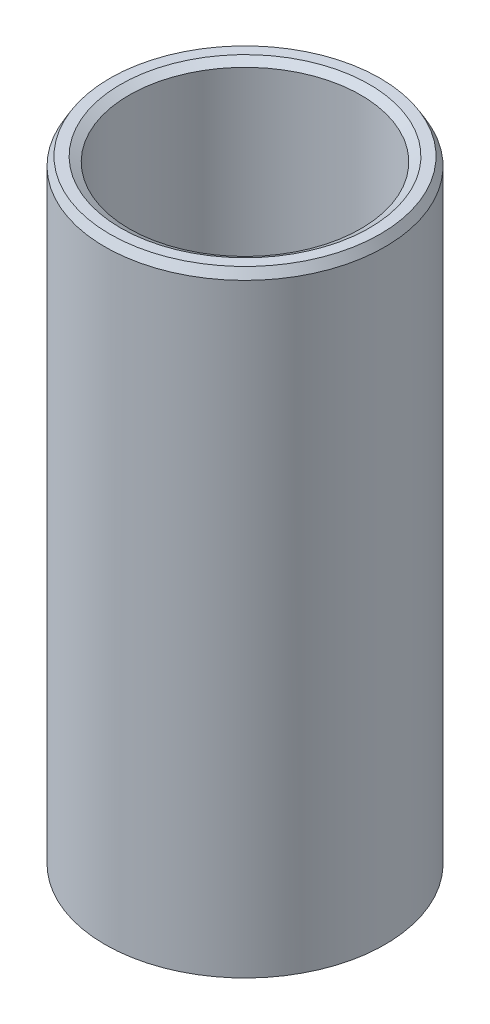
ISO-10303-21;
HEADER;
FILE_DESCRIPTION(('STEP AP214'),'2;1');
FILE_NAME('part.step','',(''),(''),'','','');
FILE_SCHEMA(('AUTOMOTIVE_DESIGN { 1 0 10303 214 1 1 1 1 }'));
ENDSEC;
DATA;
#1=APPLICATION_CONTEXT('core data for automotive mechanical design processes');
#2=APPLICATION_PROTOCOL_DEFINITION('international standard','automotive_design',2000,#1);
#3=PRODUCT_CONTEXT('',#1,'mechanical');
#4=PRODUCT('Part','Part','',(#3));
#5=PRODUCT_RELATED_PRODUCT_CATEGORY('part','',(#4));
#6=PRODUCT_DEFINITION_FORMATION('','',#4);
#7=PRODUCT_DEFINITION_CONTEXT('part definition',#1,'design');
#8=PRODUCT_DEFINITION('design','',#6,#7);
#9=PRODUCT_DEFINITION_SHAPE('','',#8);
#10=(LENGTH_UNIT() NAMED_UNIT(*) SI_UNIT(.MILLI.,.METRE.));
#11=(NAMED_UNIT(*) PLANE_ANGLE_UNIT() SI_UNIT($,.RADIAN.));
#12=(NAMED_UNIT(*) SI_UNIT($,.STERADIAN.) SOLID_ANGLE_UNIT());
#13=UNCERTAINTY_MEASURE_WITH_UNIT(LENGTH_MEASURE(1.E-05),#10,'distance_accuracy_value','');
#14=(GEOMETRIC_REPRESENTATION_CONTEXT(3) GLOBAL_UNCERTAINTY_ASSIGNED_CONTEXT((#13)) GLOBAL_UNIT_ASSIGNED_CONTEXT((#10,
#11,#12)) REPRESENTATION_CONTEXT('',''));
#15=CARTESIAN_POINT('',(0.,0.,0.));
#16=DIRECTION('',(0.,0.,1.));
#17=DIRECTION('',(1.,0.,0.));
#18=AXIS2_PLACEMENT_3D('',#15,#16,#17);
#19=CARTESIAN_POINT('',(0.,198.479711633485,0.));
#20=DIRECTION('',(0.,-1.,0.));
#21=DIRECTION('',(0.,0.,-1.));
#22=AXIS2_PLACEMENT_3D('',#19,#20,#21);
#23=CYLINDRICAL_SURFACE('',#22,45.);
#24=CARTESIAN_POINT('',(0.,1.58917507825154,0.));
#25=DIRECTION('',(0.,1.,0.));
#26=DIRECTION('',(0.,0.,1.));
#27=AXIS2_PLACEMENT_3D('',#24,#25,#26);
#28=CIRCLE('',#27,45.);
#29=CARTESIAN_POINT('',(0.,1.58917507825154,45.));
#30=VERTEX_POINT('',#29);
#31=EDGE_CURVE('E10',#30,#30,#28,.T.);
#32=ORIENTED_EDGE('',*,*,#31,.T.);
#33=EDGE_LOOP('',(#32));
#34=FACE_BOUND('',#33,.T.);
#35=CARTESIAN_POINT('',(0.,195.727179655831,0.));
#36=DIRECTION('',(0.,1.,0.));
#37=DIRECTION('',(0.,0.,1.));
#38=AXIS2_PLACEMENT_3D('',#35,#36,#37);
#39=CIRCLE('',#38,45.);
#40=CARTESIAN_POINT('',(0.,195.727179655831,-45.));
#41=VERTEX_POINT('',#40);
#42=EDGE_CURVE('E50',#41,#41,#39,.F.);
#43=ORIENTED_EDGE('',*,*,#42,.T.);
#44=EDGE_LOOP('',(#43));
#45=FACE_BOUND('',#44,.T.);
#46=ADVANCED_FACE('F39',(#34,#45),#23,.T.);
#47=CARTESIAN_POINT('',(0.,198.479711633485,0.));
#48=DIRECTION('',(0.,1.,0.));
#49=DIRECTION('',(0.,0.,1.));
#50=AXIS2_PLACEMENT_3D('',#47,#48,#49);
#51=PLANE('',#50);
#52=CARTESIAN_POINT('',(0.,198.479711633485,0.));
#53=DIRECTION('',(0.,1.,0.));
#54=DIRECTION('',(0.,0.,1.));
#55=AXIS2_PLACEMENT_3D('',#52,#53,#54);
#56=CIRCLE('',#55,39.9764231224222);
#57=CARTESIAN_POINT('',(0.,198.479711633485,39.9764231224222));
#58=VERTEX_POINT('',#57);
#59=EDGE_CURVE('E58',#58,#58,#56,.F.);
#60=ORIENTED_EDGE('',*,*,#59,.T.);
#61=EDGE_LOOP('',(#60));
#62=FACE_BOUND('',#61,.T.);
#63=CARTESIAN_POINT('',(0.,198.479711633485,0.));
#64=DIRECTION('',(0.,1.,0.));
#65=DIRECTION('',(0.,0.,1.));
#66=AXIS2_PLACEMENT_3D('',#63,#64,#65);
#67=CIRCLE('',#66,43.4108249217484);
#68=CARTESIAN_POINT('',(0.,198.479711633485,-43.4108249217484));
#69=VERTEX_POINT('',#68);
#70=EDGE_CURVE('E61',#69,#69,#67,.T.);
#71=ORIENTED_EDGE('',*,*,#70,.T.);
#72=EDGE_LOOP('',(#71));
#73=FACE_BOUND('',#72,.T.);
#74=ADVANCED_FACE('F88',(#62,#73),#51,.T.);
#75=CARTESIAN_POINT('',(0.,0.,0.));
#76=DIRECTION('',(0.,1.,0.));
#77=DIRECTION('',(0.,0.,1.));
#78=AXIS2_PLACEMENT_3D('',#75,#76,#77);
#79=PLANE('',#78);
#80=CARTESIAN_POINT('',(0.,0.,0.));
#81=DIRECTION('',(0.,1.,0.));
#82=DIRECTION('',(0.,0.,1.));
#83=AXIS2_PLACEMENT_3D('',#80,#81,#82);
#84=CIRCLE('',#83,38.8130662230198);
#85=CARTESIAN_POINT('',(0.,0.,38.8130662230198));
#86=VERTEX_POINT('',#85);
#87=EDGE_CURVE('E51',#86,#86,#84,.T.);
#88=ORIENTED_EDGE('',*,*,#87,.T.);
#89=EDGE_LOOP('',(#88));
#90=FACE_BOUND('',#89,.T.);
#91=CARTESIAN_POINT('',(0.,0.,0.));
#92=DIRECTION('',(0.,1.,0.));
#93=DIRECTION('',(0.,0.,1.));
#94=AXIS2_PLACEMENT_3D('',#91,#92,#93);
#95=CIRCLE('',#94,42.2474680223461);
#96=CARTESIAN_POINT('',(0.,0.,42.2474680223461));
#97=VERTEX_POINT('',#96);
#98=EDGE_CURVE('E54',#97,#97,#95,.F.);
#99=ORIENTED_EDGE('',*,*,#98,.T.);
#100=EDGE_LOOP('',(#99));
#101=FACE_BOUND('',#100,.T.);
#102=ADVANCED_FACE('F83',(#90,#101),#79,.F.);
#103=CARTESIAN_POINT('',(0.,198.479711633485,0.));
#104=DIRECTION('',(0.,-1.,0.));
#105=DIRECTION('',(0.,0.,-1.));
#106=AXIS2_PLACEMENT_3D('',#103,#104,#105);
#107=CYLINDRICAL_SURFACE('',#106,37.2238911447682);
#108=CARTESIAN_POINT('',(0.,196.890536555234,0.));
#109=DIRECTION('',(0.,1.,0.));
#110=DIRECTION('',(0.,0.,1.));
#111=AXIS2_PLACEMENT_3D('',#108,#109,#110);
#112=CIRCLE('',#111,37.2238911447682);
#113=CARTESIAN_POINT('',(0.,196.890536555234,37.2238911447682));
#114=VERTEX_POINT('',#113);
#115=EDGE_CURVE('E67',#114,#114,#112,.T.);
#116=ORIENTED_EDGE('',*,*,#115,.T.);
#117=EDGE_LOOP('',(#116));
#118=FACE_BOUND('',#117,.T.);
#119=CARTESIAN_POINT('',(0.,2.75253197765396,0.));
#120=DIRECTION('',(0.,1.,0.));
#121=DIRECTION('',(0.,0.,1.));
#122=AXIS2_PLACEMENT_3D('',#119,#120,#121);
#123=CIRCLE('',#122,37.2238911447682);
#124=CARTESIAN_POINT('',(0.,2.75253197765396,37.2238911447682));
#125=VERTEX_POINT('',#124);
#126=EDGE_CURVE('E69',#125,#125,#123,.F.);
#127=ORIENTED_EDGE('',*,*,#126,.T.);
#128=EDGE_LOOP('',(#127));
#129=FACE_BOUND('',#128,.T.);
#130=ADVANCED_FACE('F71',(#118,#129),#107,.F.);
#131=CARTESIAN_POINT('',(0.,196.890536555234,0.));
#132=DIRECTION('',(0.,1.,0.));
#133=DIRECTION('',(0.,0.,1.));
#134=AXIS2_PLACEMENT_3D('',#131,#132,#133);
#135=CONICAL_SURFACE('',#134,37.2238911447682,1.0471975511966);
#136=ORIENTED_EDGE('',*,*,#59,.F.);
#137=EDGE_LOOP('',(#136));
#138=FACE_BOUND('',#137,.T.);
#139=ORIENTED_EDGE('',*,*,#115,.F.);
#140=EDGE_LOOP('',(#139));
#141=FACE_BOUND('',#140,.T.);
#142=ADVANCED_FACE('F77',(#138,#141),#135,.F.);
#143=CARTESIAN_POINT('',(0.,0.,0.));
#144=DIRECTION('',(0.,-1.,0.));
#145=DIRECTION('',(0.,0.,-1.));
#146=AXIS2_PLACEMENT_3D('',#143,#144,#145);
#147=CONICAL_SURFACE('',#146,38.8130662230198,0.523598775598298);
#148=ORIENTED_EDGE('',*,*,#126,.F.);
#149=EDGE_LOOP('',(#148));
#150=FACE_BOUND('',#149,.T.);
#151=ORIENTED_EDGE('',*,*,#87,.F.);
#152=EDGE_LOOP('',(#151));
#153=FACE_BOUND('',#152,.T.);
#154=ADVANCED_FACE('F73',(#150,#153),#147,.F.);
#155=CARTESIAN_POINT('',(0.,1.58917507825154,0.));
#156=DIRECTION('',(0.,1.,0.));
#157=DIRECTION('',(0.,0.,1.));
#158=AXIS2_PLACEMENT_3D('',#155,#156,#157);
#159=CONICAL_SURFACE('',#158,45.,1.0471975511966);
#160=ORIENTED_EDGE('',*,*,#98,.F.);
#161=EDGE_LOOP('',(#160));
#162=FACE_BOUND('',#161,.T.);
#163=ORIENTED_EDGE('',*,*,#31,.F.);
#164=EDGE_LOOP('',(#163));
#165=FACE_BOUND('',#164,.T.);
#166=ADVANCED_FACE('F76',(#162,#165),#159,.T.);
#167=CARTESIAN_POINT('',(0.,198.479711633485,0.));
#168=DIRECTION('',(0.,-1.,0.));
#169=DIRECTION('',(0.,0.,-1.));
#170=AXIS2_PLACEMENT_3D('',#167,#168,#169);
#171=CONICAL_SURFACE('',#170,43.4108249217484,0.5235987755983);
#172=CARTESIAN_POINT('',(0.,195.727179655831,-45.));
#173=CARTESIAN_POINT('',(0.,195.755851863932,-44.9834460929349));
#174=CARTESIAN_POINT('',(0.,195.784524072032,-44.9668921858698));
#175=CARTESIAN_POINT('',(0.,195.841868488233,-44.9337843717395));
#176=CARTESIAN_POINT('',(0.,195.870540696334,-44.9172304646744));
#177=CARTESIAN_POINT('',(0.,195.927885112535,-44.8841226505442));
#178=CARTESIAN_POINT('',(0.,195.956557320636,-44.867568743479));
#179=CARTESIAN_POINT('',(0.,196.013901736837,-44.8344609293488));
#180=CARTESIAN_POINT('',(0.,196.042573944937,-44.8179070222837));
#181=CARTESIAN_POINT('',(0.,196.099918361138,-44.7847992081534));
#182=CARTESIAN_POINT('',(0.,196.128590569239,-44.7682453010883));
#183=CARTESIAN_POINT('',(0.,196.18593498544,-44.7351374869581));
#184=CARTESIAN_POINT('',(0.,196.214607193541,-44.718583579893));
#185=CARTESIAN_POINT('',(0.,196.271951609742,-44.6854757657627));
#186=CARTESIAN_POINT('',(0.,196.300623817842,-44.6689218586976));
#187=CARTESIAN_POINT('',(0.,196.357968234044,-44.6358140445674));
#188=CARTESIAN_POINT('',(0.,196.386640442144,-44.6192601375022));
#189=CARTESIAN_POINT('',(0.,196.443984858345,-44.586152323372));
#190=CARTESIAN_POINT('',(0.,196.472657066446,-44.5695984163069));
#191=CARTESIAN_POINT('',(0.,196.530001482647,-44.5364906021766));
#192=CARTESIAN_POINT('',(0.,196.558673690747,-44.5199366951115));
#193=CARTESIAN_POINT('',(0.,196.616018106949,-44.4868288809813));
#194=CARTESIAN_POINT('',(0.,196.644690315049,-44.4702749739161));
#195=CARTESIAN_POINT('',(0.,196.70203473125,-44.4371671597859));
#196=CARTESIAN_POINT('',(0.,196.730706939351,-44.4206132527208));
#197=CARTESIAN_POINT('',(0.,196.788051355552,-44.3875054385905));
#198=CARTESIAN_POINT('',(0.,196.816723563653,-44.3709515315254));
#199=CARTESIAN_POINT('',(0.,196.874067979854,-44.3378437173952));
#200=CARTESIAN_POINT('',(0.,196.902740187954,-44.3212898103301));
#201=CARTESIAN_POINT('',(0.,196.960084604155,-44.2881819961998));
#202=CARTESIAN_POINT('',(0.,196.988756812256,-44.2716280891347));
#203=CARTESIAN_POINT('',(0.,197.046101228457,-44.2385202750045));
#204=CARTESIAN_POINT('',(0.,197.074773436558,-44.2219663679393));
#205=CARTESIAN_POINT('',(0.,197.132117852759,-44.1888585538091));
#206=CARTESIAN_POINT('',(0.,197.160790060859,-44.172304646744));
#207=CARTESIAN_POINT('',(0.,197.21813447706,-44.1391968326137));
#208=CARTESIAN_POINT('',(0.,197.246806685161,-44.1226429255486));
#209=CARTESIAN_POINT('',(0.,197.304151101362,-44.0895351114184));
#210=CARTESIAN_POINT('',(0.,197.332823309463,-44.0729812043532));
#211=CARTESIAN_POINT('',(0.,197.390167725664,-44.039873390223));
#212=CARTESIAN_POINT('',(0.,197.418839933764,-44.0233194831579));
#213=CARTESIAN_POINT('',(0.,197.476184349966,-43.9902116690276));
#214=CARTESIAN_POINT('',(0.,197.504856558066,-43.9736577619625));
#215=CARTESIAN_POINT('',(0.,197.562200974267,-43.9405499478323));
#216=CARTESIAN_POINT('',(0.,197.590873182368,-43.9239960407672));
#217=CARTESIAN_POINT('',(0.,197.648217598569,-43.8908882266369));
#218=CARTESIAN_POINT('',(0.,197.676889806669,-43.8743343195718));
#219=CARTESIAN_POINT('',(0.,197.734234222871,-43.8412265054416));
#220=CARTESIAN_POINT('',(0.,197.762906430971,-43.8246725983764));
#221=CARTESIAN_POINT('',(0.,197.820250847172,-43.7915647842462));
#222=CARTESIAN_POINT('',(0.,197.848923055273,-43.7750108771811));
#223=CARTESIAN_POINT('',(0.,197.906267471474,-43.7419030630508));
#224=CARTESIAN_POINT('',(0.,197.934939679575,-43.7253491559857));
#225=CARTESIAN_POINT('',(0.,197.992284095776,-43.6922413418555));
#226=CARTESIAN_POINT('',(0.,198.020956303876,-43.6756874347903));
#227=CARTESIAN_POINT('',(0.,198.078300720077,-43.6425796206601));
#228=CARTESIAN_POINT('',(0.,198.106972928178,-43.626025713595));
#229=CARTESIAN_POINT('',(0.,198.164317344379,-43.5929178994647));
#230=CARTESIAN_POINT('',(0.,198.19298955248,-43.5763639923996));
#231=CARTESIAN_POINT('',(0.,198.250333968681,-43.5432561782694));
#232=CARTESIAN_POINT('',(0.,198.279006176781,-43.5267022712043));
#233=CARTESIAN_POINT('',(0.,198.336350592982,-43.493594457074));
#234=CARTESIAN_POINT('',(0.,198.365022801083,-43.4770405500089));
#235=CARTESIAN_POINT('',(0.,198.422367217284,-43.4439327358787));
#236=CARTESIAN_POINT('',(0.,198.451039425385,-43.4273788288135));
#237=CARTESIAN_POINT('',(0.,198.479711633485,-43.4108249217484));
#238=B_SPLINE_CURVE_WITH_KNOTS('',3,(#172,#173,#174,#175,#176,#177,#178,#179,#180,#181,#182,
#183,#184,#185,#186,#187,#188,#189,#190,#191,#192,#193,#194,#195,#196,#197,#198,#199,#200,#201,
#202,#203,#204,#205,#206,#207,#208,#209,#210,#211,#212,#213,#214,#215,#216,#217,#218,#219,#220,
#221,#222,#223,#224,#225,#226,#227,#228,#229,#230,#231,#232,#233,#234,#235,#236,#237),
.UNSPECIFIED.,.F.,.F.,(4,2,2,2,2,2,2,2,2,2,2,2,2,2,2,2,2,2,2,2,2,2,2,2,2,2,2,2,2,2,2,2,4),(0.,
0.0993234423907236,0.198646884781451,0.297970327172174,0.397293769562898,0.496617211953625,
0.595940654344349,0.695264096735076,0.794587539125799,0.893910981516523,0.99323442390725,
1.09255786629797,1.1918813086887,1.29120475107942,1.39052819347015,1.48985163586087,
1.5891750782516,1.68849852064233,1.78782196303305,1.88714540542378,1.9864688478145,
2.08579229020522,2.18511573259595,2.28443917498667,2.38376261737743,2.48308605976815,
2.58240950215887,2.6817329445496,2.78105638694032,2.88037982933105,2.97970327172177,
3.0790267141125,3.17835015650322),.UNSPECIFIED.);
#239=EDGE_CURVE('BSEAM45',#41,#69,#238,.T.);
#240=ORIENTED_EDGE('',*,*,#42,.F.);
#241=ORIENTED_EDGE('',*,*,#70,.F.);
#242=ORIENTED_EDGE('',*,*,#239,.T.);
#243=ORIENTED_EDGE('',*,*,#239,.F.);
#244=EDGE_LOOP('',(#240,#242,#241,#243));
#245=FACE_BOUND('',#244,.T.);
#246=ADVANCED_FACE('F45',(#245),#171,.T.);
#247=CLOSED_SHELL('',(#46,#74,#102,#130,#142,#154,#166,#246));
#248=MANIFOLD_SOLID_BREP('B2',#247);
#249=ADVANCED_BREP_SHAPE_REPRESENTATION('',(#18,#248),#14);
#250=SHAPE_DEFINITION_REPRESENTATION(#9,#249);
ENDSEC;
END-ISO-10303-21;
